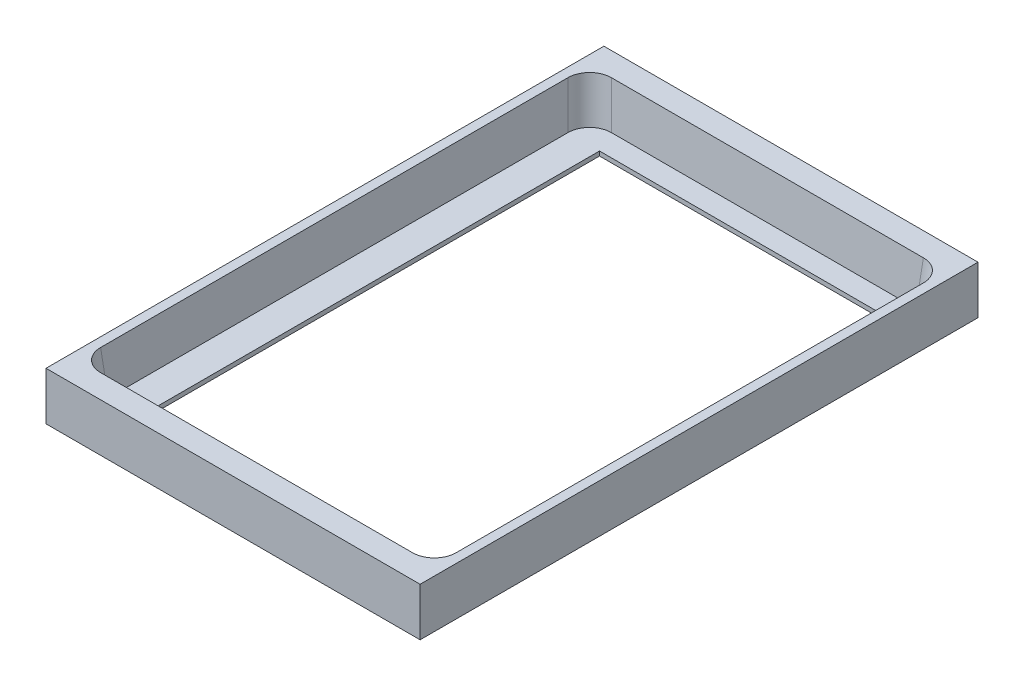
ISO-10303-21;
HEADER;
FILE_DESCRIPTION(('STEP AP214'),'2;1');
FILE_NAME('part.step','',(''),(''),'','','');
FILE_SCHEMA(('AUTOMOTIVE_DESIGN { 1 0 10303 214 1 1 1 1 }'));
ENDSEC;
DATA;
#1=APPLICATION_CONTEXT('core data for automotive mechanical design processes');
#2=APPLICATION_PROTOCOL_DEFINITION('international standard','automotive_design',2000,#1);
#3=PRODUCT_CONTEXT('',#1,'mechanical');
#4=PRODUCT('Part','Part','',(#3));
#5=PRODUCT_RELATED_PRODUCT_CATEGORY('part','',(#4));
#6=PRODUCT_DEFINITION_FORMATION('','',#4);
#7=PRODUCT_DEFINITION_CONTEXT('part definition',#1,'design');
#8=PRODUCT_DEFINITION('design','',#6,#7);
#9=PRODUCT_DEFINITION_SHAPE('','',#8);
#10=(LENGTH_UNIT() NAMED_UNIT(*) SI_UNIT(.MILLI.,.METRE.));
#11=(NAMED_UNIT(*) PLANE_ANGLE_UNIT() SI_UNIT($,.RADIAN.));
#12=(NAMED_UNIT(*) SI_UNIT($,.STERADIAN.) SOLID_ANGLE_UNIT());
#13=UNCERTAINTY_MEASURE_WITH_UNIT(LENGTH_MEASURE(1.E-05),#10,'distance_accuracy_value','');
#14=(GEOMETRIC_REPRESENTATION_CONTEXT(3) GLOBAL_UNCERTAINTY_ASSIGNED_CONTEXT((#13)) GLOBAL_UNIT_ASSIGNED_CONTEXT((#10,
#11,#12)) REPRESENTATION_CONTEXT('',''));
#15=CARTESIAN_POINT('',(0.,0.,0.));
#16=DIRECTION('',(0.,0.,1.));
#17=DIRECTION('',(1.,0.,0.));
#18=AXIS2_PLACEMENT_3D('',#15,#16,#17);
#19=CARTESIAN_POINT('',(34.8065773584093,0.864986880313125,-52.5565773584093));
#20=DIRECTION('',(0.0868265938642478,0.992432509138967,-0.0868265938642478));
#21=DIRECTION('',(-0.996194698091746,0.0871557427476584,0.));
#22=AXIS2_PLACEMENT_3D('',#19,#20,#21);
#23=CYLINDRICAL_SURFACE('',#22,5.);
#24=DIRECTION('',(0.0868265938642478,0.992432509138967,-0.0868265938642478));
#25=VECTOR('',#24,1.);
#26=CARTESIAN_POINT('',(39.787550848868,0.429208166574834,-52.5565773584093));
#27=LINE('',#26,#25);
#28=CARTESIAN_POINT('',(40.6248866352592,10.,-53.3939131448005));
#29=VERTEX_POINT('',#28);
#30=CARTESIAN_POINT('',(39.75,0.,-52.5190265095413));
#31=VERTEX_POINT('',#30);
#32=EDGE_CURVE('E265',#29,#31,#27,.F.);
#33=ORIENTED_EDGE('',*,*,#32,.F.);
#34=CARTESIAN_POINT('',(35.6057874475425,10.,-53.3557874475425));
#35=DIRECTION('',(0.,1.,0.));
#36=DIRECTION('',(0.707106781186548,0.,-0.707106781186547));
#37=AXIS2_PLACEMENT_3D('',#34,#35,#36);
#38=ELLIPSE('',#37,5.03812597225175,5.);
#39=CARTESIAN_POINT('',(35.6439131448005,10.,-58.3748866352592));
#40=VERTEX_POINT('',#39);
#41=EDGE_CURVE('E11',#29,#40,#38,.T.);
#42=ORIENTED_EDGE('',*,*,#41,.T.);
#43=DIRECTION('',(-0.0868265938642478,-0.992432509138967,0.0868265938642478));
#44=VECTOR('',#43,1.);
#45=CARTESIAN_POINT('',(34.8065773584093,0.429208166574834,-57.537550848868));
#46=LINE('',#45,#44);
#47=CARTESIAN_POINT('',(34.7690265095413,0.,-57.5));
#48=VERTEX_POINT('',#47);
#49=EDGE_CURVE('E268',#48,#40,#46,.F.);
#50=ORIENTED_EDGE('',*,*,#49,.F.);
#51=CARTESIAN_POINT('',(34.7309008122833,0.,-52.4809008122833));
#52=DIRECTION('',(0.,1.,0.));
#53=DIRECTION('',(0.707106781186548,0.,-0.707106781186547));
#54=AXIS2_PLACEMENT_3D('',#51,#52,#53);
#55=ELLIPSE('',#54,5.03812597225175,5.);
#56=EDGE_CURVE('E42',#31,#48,#55,.T.);
#57=ORIENTED_EDGE('',*,*,#56,.F.);
#58=EDGE_LOOP('',(#33,#42,#50,#57));
#59=FACE_BOUND('',#58,.T.);
#60=ADVANCED_FACE('F35',(#59),#23,.F.);
#61=CARTESIAN_POINT('',(-34.8065773584093,0.864986880313126,-52.5565773584093));
#62=DIRECTION('',(0.0868265938642478,-0.992432509138967,0.0868265938642478));
#63=DIRECTION('',(0.,-0.0871557427476584,-0.996194698091746));
#64=AXIS2_PLACEMENT_3D('',#61,#62,#63);
#65=CYLINDRICAL_SURFACE('',#64,5.);
#66=DIRECTION('',(0.0868265938642478,-0.992432509138967,0.0868265938642478));
#67=VECTOR('',#66,1.);
#68=CARTESIAN_POINT('',(-39.787550848868,0.429208166574833,-52.5565773584093));
#69=LINE('',#68,#67);
#70=CARTESIAN_POINT('',(-39.75,0.,-52.5190265095413));
#71=VERTEX_POINT('',#70);
#72=CARTESIAN_POINT('',(-40.6248866352592,10.,-53.3939131448005));
#73=VERTEX_POINT('',#72);
#74=EDGE_CURVE('E255',#71,#73,#69,.F.);
#75=ORIENTED_EDGE('',*,*,#74,.F.);
#76=CARTESIAN_POINT('',(-34.7309008122833,0.,-52.4809008122833));
#77=DIRECTION('',(0.,1.,0.));
#78=DIRECTION('',(0.707106781186547,0.,0.707106781186548));
#79=AXIS2_PLACEMENT_3D('',#76,#77,#78);
#80=ELLIPSE('',#79,5.03812597225175,5.);
#81=CARTESIAN_POINT('',(-34.7690265095412,0.,-57.5));
#82=VERTEX_POINT('',#81);
#83=EDGE_CURVE('E261',#82,#71,#80,.T.);
#84=ORIENTED_EDGE('',*,*,#83,.F.);
#85=DIRECTION('',(0.0868265938642478,-0.992432509138967,0.0868265938642478));
#86=VECTOR('',#85,1.);
#87=CARTESIAN_POINT('',(-34.8065773584093,0.429208166574834,-57.537550848868));
#88=LINE('',#87,#86);
#89=CARTESIAN_POINT('',(-35.6439131448005,10.,-58.3748866352592));
#90=VERTEX_POINT('',#89);
#91=EDGE_CURVE('E258',#90,#82,#88,.T.);
#92=ORIENTED_EDGE('',*,*,#91,.F.);
#93=CARTESIAN_POINT('',(-35.6057874475425,10.,-53.3557874475425));
#94=DIRECTION('',(0.,1.,0.));
#95=DIRECTION('',(0.707106781186547,0.,0.707106781186548));
#96=AXIS2_PLACEMENT_3D('',#93,#94,#95);
#97=ELLIPSE('',#96,5.03812597225175,5.);
#98=EDGE_CURVE('E263',#90,#73,#97,.T.);
#99=ORIENTED_EDGE('',*,*,#98,.T.);
#100=EDGE_LOOP('',(#75,#84,#92,#99));
#101=FACE_BOUND('',#100,.T.);
#102=ADVANCED_FACE('F283',(#101),#65,.F.);
#103=CARTESIAN_POINT('',(-34.207238194945,-5.98549110517737,51.957238194945));
#104=DIRECTION('',(0.0868265938642478,-0.992432509138967,-0.0868265938642478));
#105=DIRECTION('',(0.996194698091746,0.0871557427476584,0.));
#106=AXIS2_PLACEMENT_3D('',#103,#104,#105);
#107=CYLINDRICAL_SURFACE('',#106,5.);
#108=DIRECTION('',(0.0868265938642478,-0.992432509138967,-0.0868265938642478));
#109=VECTOR('',#108,1.);
#110=CARTESIAN_POINT('',(-34.207238194945,-6.42126981891566,56.9382116854037));
#111=LINE('',#110,#109);
#112=CARTESIAN_POINT('',(-34.7690265095412,0.,57.5));
#113=VERTEX_POINT('',#112);
#114=CARTESIAN_POINT('',(-35.6439131448005,10.,58.3748866352592));
#115=VERTEX_POINT('',#114);
#116=EDGE_CURVE('E245',#113,#115,#111,.F.);
#117=ORIENTED_EDGE('',*,*,#116,.F.);
#118=CARTESIAN_POINT('',(-34.7309008122833,0.,52.4809008122833));
#119=DIRECTION('',(0.,1.,0.));
#120=DIRECTION('',(0.707106781186548,0.,-0.707106781186547));
#121=AXIS2_PLACEMENT_3D('',#118,#119,#120);
#122=ELLIPSE('',#121,5.03812597225175,5.);
#123=CARTESIAN_POINT('',(-39.75,0.,52.5190265095413));
#124=VERTEX_POINT('',#123);
#125=EDGE_CURVE('E251',#124,#113,#122,.T.);
#126=ORIENTED_EDGE('',*,*,#125,.F.);
#127=DIRECTION('',(-0.0868265938642478,0.992432509138967,0.0868265938642478));
#128=VECTOR('',#127,1.);
#129=CARTESIAN_POINT('',(-38.9205822476303,-9.48028829042399,51.6896087571716));
#130=LINE('',#129,#128);
#131=CARTESIAN_POINT('',(-40.6248866352592,10.,53.3939131448005));
#132=VERTEX_POINT('',#131);
#133=EDGE_CURVE('E248',#132,#124,#130,.F.);
#134=ORIENTED_EDGE('',*,*,#133,.F.);
#135=CARTESIAN_POINT('',(-35.6057874475425,10.,53.3557874475425));
#136=DIRECTION('',(0.,1.,0.));
#137=DIRECTION('',(0.707106781186548,0.,-0.707106781186547));
#138=AXIS2_PLACEMENT_3D('',#135,#136,#137);
#139=ELLIPSE('',#138,5.03812597225175,5.);
#140=EDGE_CURVE('E253',#132,#115,#139,.T.);
#141=ORIENTED_EDGE('',*,*,#140,.T.);
#142=EDGE_LOOP('',(#117,#126,#134,#141));
#143=FACE_BOUND('',#142,.T.);
#144=ADVANCED_FACE('F292',(#143),#107,.F.);
#145=CARTESIAN_POINT('',(33.9396087571716,-9.04450957668571,51.6896087571716));
#146=DIRECTION('',(-0.0868265938642478,-0.992432509138967,-0.0868265938642478));
#147=DIRECTION('',(0.,0.0871557427476584,-0.996194698091746));
#148=AXIS2_PLACEMENT_3D('',#145,#146,#147);
#149=CYLINDRICAL_SURFACE('',#148,5.);
#150=DIRECTION('',(0.0868265938642478,0.992432509138967,0.0868265938642478));
#151=VECTOR('',#150,1.);
#152=CARTESIAN_POINT('',(38.9205822476303,-9.480288290424,51.6896087571716));
#153=LINE('',#152,#151);
#154=CARTESIAN_POINT('',(39.75,0.,52.5190265095413));
#155=VERTEX_POINT('',#154);
#156=CARTESIAN_POINT('',(40.6248866352592,10.,53.3939131448005));
#157=VERTEX_POINT('',#156);
#158=EDGE_CURVE('E233',#155,#157,#153,.T.);
#159=ORIENTED_EDGE('',*,*,#158,.F.);
#160=CARTESIAN_POINT('',(34.7309008122833,0.,52.4809008122833));
#161=DIRECTION('',(0.,1.,0.));
#162=DIRECTION('',(-0.707106781186547,0.,-0.707106781186548));
#163=AXIS2_PLACEMENT_3D('',#160,#161,#162);
#164=ELLIPSE('',#163,5.03812597225175,5.);
#165=CARTESIAN_POINT('',(34.7690265095413,0.,57.5));
#166=VERTEX_POINT('',#165);
#167=EDGE_CURVE('E239',#166,#155,#164,.T.);
#168=ORIENTED_EDGE('',*,*,#167,.F.);
#169=DIRECTION('',(0.0868265938642478,0.992432509138967,0.0868265938642478));
#170=VECTOR('',#169,1.);
#171=CARTESIAN_POINT('',(33.9396087571716,-9.480288290424,56.6705822476303));
#172=LINE('',#171,#170);
#173=CARTESIAN_POINT('',(35.6439131448005,10.,58.3748866352593));
#174=VERTEX_POINT('',#173);
#175=EDGE_CURVE('E236',#174,#166,#172,.F.);
#176=ORIENTED_EDGE('',*,*,#175,.F.);
#177=CARTESIAN_POINT('',(35.6057874475425,10.,53.3557874475425));
#178=DIRECTION('',(0.,1.,0.));
#179=DIRECTION('',(-0.707106781186547,0.,-0.707106781186548));
#180=AXIS2_PLACEMENT_3D('',#177,#178,#179);
#181=ELLIPSE('',#180,5.03812597225175,5.);
#182=EDGE_CURVE('E242',#174,#157,#181,.T.);
#183=ORIENTED_EDGE('',*,*,#182,.T.);
#184=EDGE_LOOP('',(#159,#168,#176,#183));
#185=FACE_BOUND('',#184,.T.);
#186=ADVANCED_FACE('F300',(#185),#149,.F.);
#187=CARTESIAN_POINT('',(42.75,10.,-63.75));
#188=DIRECTION('',(-1.,0.,0.));
#189=DIRECTION('',(0.,0.,1.));
#190=AXIS2_PLACEMENT_3D('',#187,#188,#189);
#191=PLANE('',#190);
#192=DIRECTION('',(0.,-1.,0.));
#193=VECTOR('',#192,1.);
#194=CARTESIAN_POINT('',(42.75,10.,63.75));
#195=LINE('',#194,#193);
#196=CARTESIAN_POINT('',(42.75,10.,63.75));
#197=VERTEX_POINT('',#196);
#198=CARTESIAN_POINT('',(42.75,-1.,63.75));
#199=VERTEX_POINT('',#198);
#200=EDGE_CURVE('E225',#197,#199,#195,.T.);
#201=ORIENTED_EDGE('',*,*,#200,.T.);
#202=DIRECTION('',(0.,0.,1.));
#203=VECTOR('',#202,1.);
#204=CARTESIAN_POINT('',(42.75,-1.,63.75));
#205=LINE('',#204,#203);
#206=CARTESIAN_POINT('',(42.75,-1.,-63.75));
#207=VERTEX_POINT('',#206);
#208=EDGE_CURVE('E192',#207,#199,#205,.T.);
#209=ORIENTED_EDGE('',*,*,#208,.F.);
#210=DIRECTION('',(0.,-1.,0.));
#211=VECTOR('',#210,1.);
#212=CARTESIAN_POINT('',(42.75,10.,-63.75));
#213=LINE('',#212,#211);
#214=CARTESIAN_POINT('',(42.75,10.,-63.75));
#215=VERTEX_POINT('',#214);
#216=EDGE_CURVE('E231',#215,#207,#213,.T.);
#217=ORIENTED_EDGE('',*,*,#216,.F.);
#218=DIRECTION('',(0.,0.,-1.));
#219=VECTOR('',#218,1.);
#220=CARTESIAN_POINT('',(42.75,10.,-63.75));
#221=LINE('',#220,#219);
#222=EDGE_CURVE('E213',#197,#215,#221,.T.);
#223=ORIENTED_EDGE('',*,*,#222,.F.);
#224=EDGE_LOOP('',(#201,#209,#217,#223));
#225=FACE_BOUND('',#224,.T.);
#226=ADVANCED_FACE('F315',(#225),#191,.F.);
#227=CARTESIAN_POINT('',(-42.75,10.,-63.75));
#228=DIRECTION('',(0.,0.,1.));
#229=DIRECTION('',(1.,0.,0.));
#230=AXIS2_PLACEMENT_3D('',#227,#228,#229);
#231=PLANE('',#230);
#232=ORIENTED_EDGE('',*,*,#216,.T.);
#233=DIRECTION('',(1.,0.,0.));
#234=VECTOR('',#233,1.);
#235=CARTESIAN_POINT('',(42.75,-1.,-63.75));
#236=LINE('',#235,#234);
#237=CARTESIAN_POINT('',(-42.75,-1.,-63.75));
#238=VERTEX_POINT('',#237);
#239=EDGE_CURVE('E189',#238,#207,#236,.T.);
#240=ORIENTED_EDGE('',*,*,#239,.F.);
#241=DIRECTION('',(0.,-1.,0.));
#242=VECTOR('',#241,1.);
#243=CARTESIAN_POINT('',(-42.75,10.,-63.75));
#244=LINE('',#243,#242);
#245=CARTESIAN_POINT('',(-42.75,10.,-63.75));
#246=VERTEX_POINT('',#245);
#247=EDGE_CURVE('E229',#246,#238,#244,.T.);
#248=ORIENTED_EDGE('',*,*,#247,.F.);
#249=DIRECTION('',(-1.,0.,0.));
#250=VECTOR('',#249,1.);
#251=CARTESIAN_POINT('',(-42.75,10.,-63.75));
#252=LINE('',#251,#250);
#253=EDGE_CURVE('E219',#215,#246,#252,.T.);
#254=ORIENTED_EDGE('',*,*,#253,.F.);
#255=EDGE_LOOP('',(#232,#240,#248,#254));
#256=FACE_BOUND('',#255,.T.);
#257=ADVANCED_FACE('F318',(#256),#231,.F.);
#258=CARTESIAN_POINT('',(-42.75,10.,-63.75));
#259=DIRECTION('',(1.,0.,0.));
#260=DIRECTION('',(0.,0.,-1.));
#261=AXIS2_PLACEMENT_3D('',#258,#259,#260);
#262=PLANE('',#261);
#263=ORIENTED_EDGE('',*,*,#247,.T.);
#264=DIRECTION('',(0.,0.,-1.));
#265=VECTOR('',#264,1.);
#266=CARTESIAN_POINT('',(-42.75,-1.,63.75));
#267=LINE('',#266,#265);
#268=CARTESIAN_POINT('',(-42.75,-1.,63.75));
#269=VERTEX_POINT('',#268);
#270=EDGE_CURVE('E186',#269,#238,#267,.T.);
#271=ORIENTED_EDGE('',*,*,#270,.F.);
#272=DIRECTION('',(0.,-1.,0.));
#273=VECTOR('',#272,1.);
#274=CARTESIAN_POINT('',(-42.75,10.,63.75));
#275=LINE('',#274,#273);
#276=CARTESIAN_POINT('',(-42.75,10.,63.75));
#277=VERTEX_POINT('',#276);
#278=EDGE_CURVE('E227',#277,#269,#275,.T.);
#279=ORIENTED_EDGE('',*,*,#278,.F.);
#280=DIRECTION('',(0.,0.,1.));
#281=VECTOR('',#280,1.);
#282=CARTESIAN_POINT('',(-42.75,10.,-63.75));
#283=LINE('',#282,#281);
#284=EDGE_CURVE('E221',#246,#277,#283,.T.);
#285=ORIENTED_EDGE('',*,*,#284,.F.);
#286=EDGE_LOOP('',(#263,#271,#279,#285));
#287=FACE_BOUND('',#286,.T.);
#288=ADVANCED_FACE('F322',(#287),#262,.F.);
#289=CARTESIAN_POINT('',(-42.75,10.,63.75));
#290=DIRECTION('',(0.,0.,-1.));
#291=DIRECTION('',(-1.,0.,0.));
#292=AXIS2_PLACEMENT_3D('',#289,#290,#291);
#293=PLANE('',#292);
#294=ORIENTED_EDGE('',*,*,#278,.T.);
#295=DIRECTION('',(-1.,0.,0.));
#296=VECTOR('',#295,1.);
#297=CARTESIAN_POINT('',(42.75,-1.,63.75));
#298=LINE('',#297,#296);
#299=EDGE_CURVE('E195',#199,#269,#298,.T.);
#300=ORIENTED_EDGE('',*,*,#299,.F.);
#301=ORIENTED_EDGE('',*,*,#200,.F.);
#302=DIRECTION('',(1.,0.,0.));
#303=VECTOR('',#302,1.);
#304=CARTESIAN_POINT('',(-42.75,10.,63.75));
#305=LINE('',#304,#303);
#306=EDGE_CURVE('E223',#277,#197,#305,.T.);
#307=ORIENTED_EDGE('',*,*,#306,.F.);
#308=EDGE_LOOP('',(#294,#300,#301,#307));
#309=FACE_BOUND('',#308,.T.);
#310=ADVANCED_FACE('F326',(#309),#293,.F.);
#311=CARTESIAN_POINT('',(0.,10.,0.));
#312=DIRECTION('',(0.,1.,0.));
#313=DIRECTION('',(0.,0.,1.));
#314=AXIS2_PLACEMENT_3D('',#311,#312,#313);
#315=PLANE('',#314);
#316=ORIENTED_EDGE('',*,*,#41,.F.);
#317=DIRECTION('',(0.,0.,1.));
#318=VECTOR('',#317,1.);
#319=CARTESIAN_POINT('',(40.6248866352592,10.,-57.5));
#320=LINE('',#319,#318);
#321=EDGE_CURVE('E211',#29,#157,#320,.T.);
#322=ORIENTED_EDGE('',*,*,#321,.T.);
#323=ORIENTED_EDGE('',*,*,#182,.F.);
#324=DIRECTION('',(-1.,0.,0.));
#325=VECTOR('',#324,1.);
#326=CARTESIAN_POINT('',(39.75,10.,58.3748866352593));
#327=LINE('',#326,#325);
#328=EDGE_CURVE('E207',#174,#115,#327,.T.);
#329=ORIENTED_EDGE('',*,*,#328,.T.);
#330=ORIENTED_EDGE('',*,*,#140,.F.);
#331=DIRECTION('',(0.,0.,-1.));
#332=VECTOR('',#331,1.);
#333=CARTESIAN_POINT('',(-40.6248866352592,10.,-57.5));
#334=LINE('',#333,#332);
#335=EDGE_CURVE('E210',#73,#132,#334,.F.);
#336=ORIENTED_EDGE('',*,*,#335,.F.);
#337=ORIENTED_EDGE('',*,*,#98,.F.);
#338=DIRECTION('',(1.,0.,0.));
#339=VECTOR('',#338,1.);
#340=CARTESIAN_POINT('',(39.75,10.,-58.3748866352592));
#341=LINE('',#340,#339);
#342=EDGE_CURVE('E214',#40,#90,#341,.F.);
#343=ORIENTED_EDGE('',*,*,#342,.F.);
#344=EDGE_LOOP('',(#316,#322,#323,#329,#330,#336,#337,#343));
#345=FACE_BOUND('',#344,.T.);
#346=ORIENTED_EDGE('',*,*,#222,.T.);
#347=ORIENTED_EDGE('',*,*,#253,.T.);
#348=ORIENTED_EDGE('',*,*,#284,.T.);
#349=ORIENTED_EDGE('',*,*,#306,.T.);
#350=EDGE_LOOP('',(#346,#347,#348,#349));
#351=FACE_BOUND('',#350,.T.);
#352=ADVANCED_FACE('F275',(#345,#351),#315,.T.);
#353=CARTESIAN_POINT('',(39.75,0.,57.5));
#354=DIRECTION('',(0.,-0.0871557427476584,0.996194698091745));
#355=DIRECTION('',(0.,-0.996194698091746,-0.0871557427476584));
#356=AXIS2_PLACEMENT_3D('',#353,#354,#355);
#357=PLANE('',#356);
#358=DIRECTION('',(-1.,0.,0.));
#359=VECTOR('',#358,1.);
#360=CARTESIAN_POINT('',(39.75,0.,57.5));
#361=LINE('',#360,#359);
#362=EDGE_CURVE('E198',#166,#113,#361,.T.);
#363=ORIENTED_EDGE('',*,*,#362,.T.);
#364=ORIENTED_EDGE('',*,*,#116,.T.);
#365=ORIENTED_EDGE('',*,*,#328,.F.);
#366=ORIENTED_EDGE('',*,*,#175,.T.);
#367=EDGE_LOOP('',(#363,#364,#365,#366));
#368=FACE_BOUND('',#367,.T.);
#369=ADVANCED_FACE('F296',(#368),#357,.F.);
#370=CARTESIAN_POINT('',(39.75,0.,-57.5));
#371=DIRECTION('',(0.996194698091746,-0.0871557427476584,0.));
#372=DIRECTION('',(0.0871557427476584,0.996194698091746,0.));
#373=AXIS2_PLACEMENT_3D('',#370,#371,#372);
#374=PLANE('',#373);
#375=ORIENTED_EDGE('',*,*,#321,.F.);
#376=ORIENTED_EDGE('',*,*,#32,.T.);
#377=DIRECTION('',(0.,0.,1.));
#378=VECTOR('',#377,1.);
#379=CARTESIAN_POINT('',(39.75,0.,-57.5));
#380=LINE('',#379,#378);
#381=EDGE_CURVE('E205',#31,#155,#380,.T.);
#382=ORIENTED_EDGE('',*,*,#381,.T.);
#383=ORIENTED_EDGE('',*,*,#158,.T.);
#384=EDGE_LOOP('',(#375,#376,#382,#383));
#385=FACE_BOUND('',#384,.T.);
#386=ADVANCED_FACE('F303',(#385),#374,.F.);
#387=CARTESIAN_POINT('',(39.75,0.,-57.5));
#388=DIRECTION('',(0.,-0.0871557427476584,-0.996194698091745));
#389=DIRECTION('',(0.,0.996194698091746,-0.0871557427476584));
#390=AXIS2_PLACEMENT_3D('',#387,#388,#389);
#391=PLANE('',#390);
#392=DIRECTION('',(-1.,0.,0.));
#393=VECTOR('',#392,1.);
#394=CARTESIAN_POINT('',(39.75,0.,-57.5));
#395=LINE('',#394,#393);
#396=EDGE_CURVE('E203',#48,#82,#395,.T.);
#397=ORIENTED_EDGE('',*,*,#396,.F.);
#398=ORIENTED_EDGE('',*,*,#49,.T.);
#399=ORIENTED_EDGE('',*,*,#342,.T.);
#400=ORIENTED_EDGE('',*,*,#91,.T.);
#401=EDGE_LOOP('',(#397,#398,#399,#400));
#402=FACE_BOUND('',#401,.T.);
#403=ADVANCED_FACE('F272',(#402),#391,.F.);
#404=CARTESIAN_POINT('',(-39.75,0.,-57.5));
#405=DIRECTION('',(-0.996194698091746,-0.0871557427476584,0.));
#406=DIRECTION('',(0.0871557427476584,-0.996194698091746,0.));
#407=AXIS2_PLACEMENT_3D('',#404,#405,#406);
#408=PLANE('',#407);
#409=DIRECTION('',(0.,0.,1.));
#410=VECTOR('',#409,1.);
#411=CARTESIAN_POINT('',(-39.75,0.,-57.5));
#412=LINE('',#411,#410);
#413=EDGE_CURVE('E201',#71,#124,#412,.T.);
#414=ORIENTED_EDGE('',*,*,#413,.F.);
#415=ORIENTED_EDGE('',*,*,#74,.T.);
#416=ORIENTED_EDGE('',*,*,#335,.T.);
#417=ORIENTED_EDGE('',*,*,#133,.T.);
#418=EDGE_LOOP('',(#414,#415,#416,#417));
#419=FACE_BOUND('',#418,.T.);
#420=ADVANCED_FACE('F293',(#419),#408,.F.);
#421=CARTESIAN_POINT('',(0.,0.,0.));
#422=DIRECTION('',(0.,1.,0.));
#423=DIRECTION('',(0.,0.,1.));
#424=AXIS2_PLACEMENT_3D('',#421,#422,#423);
#425=PLANE('',#424);
#426=DIRECTION('',(0.,0.,1.));
#427=VECTOR('',#426,1.);
#428=CARTESIAN_POINT('',(-32.5,0.,0.));
#429=LINE('',#428,#427);
#430=CARTESIAN_POINT('',(-32.5,0.,-52.5));
#431=VERTEX_POINT('',#430);
#432=CARTESIAN_POINT('',(-32.5,0.,52.5));
#433=VERTEX_POINT('',#432);
#434=EDGE_CURVE('E184',#431,#433,#429,.T.);
#435=ORIENTED_EDGE('',*,*,#434,.F.);
#436=DIRECTION('',(-1.,0.,0.));
#437=VECTOR('',#436,1.);
#438=CARTESIAN_POINT('',(0.,0.,-52.5));
#439=LINE('',#438,#437);
#440=CARTESIAN_POINT('',(32.5,0.,-52.5));
#441=VERTEX_POINT('',#440);
#442=EDGE_CURVE('E177',#441,#431,#439,.T.);
#443=ORIENTED_EDGE('',*,*,#442,.F.);
#444=DIRECTION('',(0.,0.,-1.));
#445=VECTOR('',#444,1.);
#446=CARTESIAN_POINT('',(32.5,0.,0.));
#447=LINE('',#446,#445);
#448=CARTESIAN_POINT('',(32.5,0.,52.5));
#449=VERTEX_POINT('',#448);
#450=EDGE_CURVE('E152',#449,#441,#447,.T.);
#451=ORIENTED_EDGE('',*,*,#450,.F.);
#452=DIRECTION('',(1.,0.,0.));
#453=VECTOR('',#452,1.);
#454=CARTESIAN_POINT('',(0.,0.,52.5));
#455=LINE('',#454,#453);
#456=EDGE_CURVE('E182',#433,#449,#455,.T.);
#457=ORIENTED_EDGE('',*,*,#456,.F.);
#458=EDGE_LOOP('',(#435,#443,#451,#457));
#459=FACE_BOUND('',#458,.T.);
#460=ORIENTED_EDGE('',*,*,#381,.F.);
#461=ORIENTED_EDGE('',*,*,#56,.T.);
#462=ORIENTED_EDGE('',*,*,#396,.T.);
#463=ORIENTED_EDGE('',*,*,#83,.T.);
#464=ORIENTED_EDGE('',*,*,#413,.T.);
#465=ORIENTED_EDGE('',*,*,#125,.T.);
#466=ORIENTED_EDGE('',*,*,#362,.F.);
#467=ORIENTED_EDGE('',*,*,#167,.T.);
#468=EDGE_LOOP('',(#460,#461,#462,#463,#464,#465,#466,#467));
#469=FACE_BOUND('',#468,.T.);
#470=ADVANCED_FACE('F285',(#459,#469),#425,.T.);
#471=CARTESIAN_POINT('',(0.,-1.,0.));
#472=DIRECTION('',(0.,1.,0.));
#473=DIRECTION('',(0.,0.,1.));
#474=AXIS2_PLACEMENT_3D('',#471,#472,#473);
#475=PLANE('',#474);
#476=DIRECTION('',(1.,0.,0.));
#477=VECTOR('',#476,1.);
#478=CARTESIAN_POINT('',(32.5,-1.,-52.5));
#479=LINE('',#478,#477);
#480=CARTESIAN_POINT('',(-32.5,-1.,-52.5));
#481=VERTEX_POINT('',#480);
#482=CARTESIAN_POINT('',(32.5,-1.,-52.5));
#483=VERTEX_POINT('',#482);
#484=EDGE_CURVE('E160',#481,#483,#479,.T.);
#485=ORIENTED_EDGE('',*,*,#484,.F.);
#486=DIRECTION('',(0.,0.,-1.));
#487=VECTOR('',#486,1.);
#488=CARTESIAN_POINT('',(-32.5,-1.,-52.5));
#489=LINE('',#488,#487);
#490=CARTESIAN_POINT('',(-32.5,-1.,52.5));
#491=VERTEX_POINT('',#490);
#492=EDGE_CURVE('E165',#491,#481,#489,.T.);
#493=ORIENTED_EDGE('',*,*,#492,.F.);
#494=DIRECTION('',(-1.,0.,0.));
#495=VECTOR('',#494,1.);
#496=CARTESIAN_POINT('',(32.5,-1.,52.5));
#497=LINE('',#496,#495);
#498=CARTESIAN_POINT('',(32.5,-1.,52.5));
#499=VERTEX_POINT('',#498);
#500=EDGE_CURVE('E170',#499,#491,#497,.T.);
#501=ORIENTED_EDGE('',*,*,#500,.F.);
#502=DIRECTION('',(0.,0.,1.));
#503=VECTOR('',#502,1.);
#504=CARTESIAN_POINT('',(32.5,-1.,-52.5));
#505=LINE('',#504,#503);
#506=EDGE_CURVE('E149',#483,#499,#505,.T.);
#507=ORIENTED_EDGE('',*,*,#506,.F.);
#508=EDGE_LOOP('',(#485,#493,#501,#507));
#509=FACE_BOUND('',#508,.T.);
#510=ORIENTED_EDGE('',*,*,#270,.T.);
#511=ORIENTED_EDGE('',*,*,#239,.T.);
#512=ORIENTED_EDGE('',*,*,#208,.T.);
#513=ORIENTED_EDGE('',*,*,#299,.T.);
#514=EDGE_LOOP('',(#510,#511,#512,#513));
#515=FACE_BOUND('',#514,.T.);
#516=ADVANCED_FACE('F167',(#509,#515),#475,.F.);
#517=CARTESIAN_POINT('',(-32.5,0.1,-52.5));
#518=DIRECTION('',(-1.,0.,0.));
#519=DIRECTION('',(0.,0.,1.));
#520=AXIS2_PLACEMENT_3D('',#517,#518,#519);
#521=PLANE('',#520);
#522=ORIENTED_EDGE('',*,*,#434,.T.);
#523=DIRECTION('',(0.,-1.,0.));
#524=VECTOR('',#523,1.);
#525=CARTESIAN_POINT('',(-32.5,0.1,52.5));
#526=LINE('',#525,#524);
#527=EDGE_CURVE('E175',#433,#491,#526,.T.);
#528=ORIENTED_EDGE('',*,*,#527,.T.);
#529=ORIENTED_EDGE('',*,*,#492,.T.);
#530=DIRECTION('',(0.,-1.,0.));
#531=VECTOR('',#530,1.);
#532=CARTESIAN_POINT('',(-32.5,0.1,-52.5));
#533=LINE('',#532,#531);
#534=EDGE_CURVE('E156',#431,#481,#533,.T.);
#535=ORIENTED_EDGE('',*,*,#534,.F.);
#536=EDGE_LOOP('',(#522,#528,#529,#535));
#537=FACE_BOUND('',#536,.T.);
#538=ADVANCED_FACE('F346',(#537),#521,.F.);
#539=CARTESIAN_POINT('',(32.5,0.1,52.5));
#540=DIRECTION('',(0.,0.,1.));
#541=DIRECTION('',(1.,0.,0.));
#542=AXIS2_PLACEMENT_3D('',#539,#540,#541);
#543=PLANE('',#542);
#544=ORIENTED_EDGE('',*,*,#456,.T.);
#545=DIRECTION('',(0.,-1.,0.));
#546=VECTOR('',#545,1.);
#547=CARTESIAN_POINT('',(32.5,0.1,52.5));
#548=LINE('',#547,#546);
#549=EDGE_CURVE('E155',#449,#499,#548,.T.);
#550=ORIENTED_EDGE('',*,*,#549,.T.);
#551=ORIENTED_EDGE('',*,*,#500,.T.);
#552=ORIENTED_EDGE('',*,*,#527,.F.);
#553=EDGE_LOOP('',(#544,#550,#551,#552));
#554=FACE_BOUND('',#553,.T.);
#555=ADVANCED_FACE('F349',(#554),#543,.F.);
#556=CARTESIAN_POINT('',(32.5,0.1,-52.5));
#557=DIRECTION('',(1.,0.,0.));
#558=DIRECTION('',(0.,0.,-1.));
#559=AXIS2_PLACEMENT_3D('',#556,#557,#558);
#560=PLANE('',#559);
#561=ORIENTED_EDGE('',*,*,#450,.T.);
#562=DIRECTION('',(0.,-1.,0.));
#563=VECTOR('',#562,1.);
#564=CARTESIAN_POINT('',(32.5,0.1,-52.5));
#565=LINE('',#564,#563);
#566=EDGE_CURVE('E144',#441,#483,#565,.T.);
#567=ORIENTED_EDGE('',*,*,#566,.T.);
#568=ORIENTED_EDGE('',*,*,#506,.T.);
#569=ORIENTED_EDGE('',*,*,#549,.F.);
#570=EDGE_LOOP('',(#561,#567,#568,#569));
#571=FACE_BOUND('',#570,.T.);
#572=ADVANCED_FACE('F146',(#571),#560,.F.);
#573=CARTESIAN_POINT('',(32.5,0.1,-52.5));
#574=DIRECTION('',(0.,0.,-1.));
#575=DIRECTION('',(-1.,0.,0.));
#576=AXIS2_PLACEMENT_3D('',#573,#574,#575);
#577=PLANE('',#576);
#578=ORIENTED_EDGE('',*,*,#442,.T.);
#579=ORIENTED_EDGE('',*,*,#534,.T.);
#580=ORIENTED_EDGE('',*,*,#484,.T.);
#581=ORIENTED_EDGE('',*,*,#566,.F.);
#582=EDGE_LOOP('',(#578,#579,#580,#581));
#583=FACE_BOUND('',#582,.T.);
#584=ADVANCED_FACE('F161',(#583),#577,.F.);
#585=CLOSED_SHELL('',(#60,#102,#144,#186,#226,#257,#288,#310,#352,#369,#386,#403,#420,#470,#516,
#538,#555,#572,#584));
#586=MANIFOLD_SOLID_BREP('B2',#585);
#587=ADVANCED_BREP_SHAPE_REPRESENTATION('',(#18,#586),#14);
#588=SHAPE_DEFINITION_REPRESENTATION(#9,#587);
ENDSEC;
END-ISO-10303-21;
